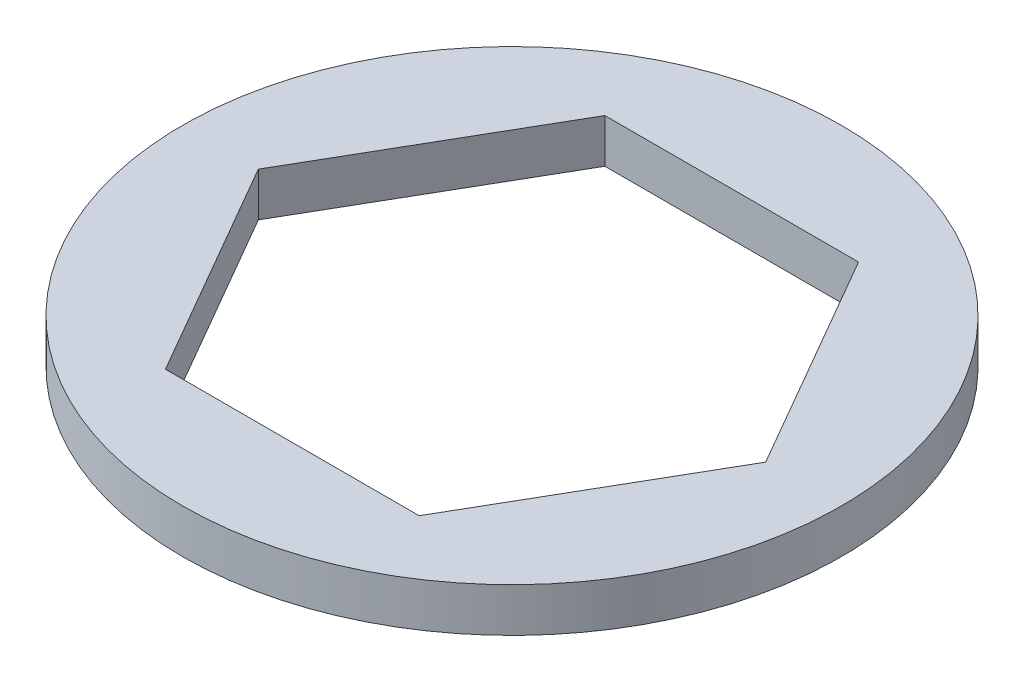
ISO-10303-21;
HEADER;
FILE_DESCRIPTION(('STEP AP214'),'2;1');
FILE_NAME('part.step','',(''),(''),'','','');
FILE_SCHEMA(('AUTOMOTIVE_DESIGN { 1 0 10303 214 1 1 1 1 }'));
ENDSEC;
DATA;
#1=APPLICATION_CONTEXT('core data for automotive mechanical design processes');
#2=APPLICATION_PROTOCOL_DEFINITION('international standard','automotive_design',2000,#1);
#3=PRODUCT_CONTEXT('',#1,'mechanical');
#4=PRODUCT('Part','Part','',(#3));
#5=PRODUCT_RELATED_PRODUCT_CATEGORY('part','',(#4));
#6=PRODUCT_DEFINITION_FORMATION('','',#4);
#7=PRODUCT_DEFINITION_CONTEXT('part definition',#1,'design');
#8=PRODUCT_DEFINITION('design','',#6,#7);
#9=PRODUCT_DEFINITION_SHAPE('','',#8);
#10=(LENGTH_UNIT() NAMED_UNIT(*) SI_UNIT(.MILLI.,.METRE.));
#11=(NAMED_UNIT(*) PLANE_ANGLE_UNIT() SI_UNIT($,.RADIAN.));
#12=(NAMED_UNIT(*) SI_UNIT($,.STERADIAN.) SOLID_ANGLE_UNIT());
#13=UNCERTAINTY_MEASURE_WITH_UNIT(LENGTH_MEASURE(1.E-05),#10,'distance_accuracy_value','');
#14=(GEOMETRIC_REPRESENTATION_CONTEXT(3) GLOBAL_UNCERTAINTY_ASSIGNED_CONTEXT((#13)) GLOBAL_UNIT_ASSIGNED_CONTEXT((#10,
#11,#12)) REPRESENTATION_CONTEXT('',''));
#15=CARTESIAN_POINT('',(0.,0.,0.));
#16=DIRECTION('',(0.,0.,1.));
#17=DIRECTION('',(1.,0.,0.));
#18=AXIS2_PLACEMENT_3D('',#15,#16,#17);
#19=CARTESIAN_POINT('',(0.,1.27,0.));
#20=DIRECTION('',(0.,1.,0.));
#21=DIRECTION('',(0.,0.,1.));
#22=AXIS2_PLACEMENT_3D('',#19,#20,#21);
#23=PLANE('',#22);
#24=CARTESIAN_POINT('',(0.,1.27,0.));
#25=DIRECTION('',(0.,1.,0.));
#26=DIRECTION('',(0.,0.,1.));
#27=AXIS2_PLACEMENT_3D('',#24,#25,#26);
#28=CIRCLE('',#27,9.525);
#29=CARTESIAN_POINT('',(0.,1.27,9.525));
#30=VERTEX_POINT('',#29);
#31=EDGE_CURVE('E11',#30,#30,#28,.T.);
#32=ORIENTED_EDGE('',*,*,#31,.T.);
#33=EDGE_LOOP('',(#32));
#34=FACE_BOUND('',#33,.T.);
#35=DIRECTION('',(-1.,0.,0.));
#36=VECTOR('',#35,1.);
#37=CARTESIAN_POINT('',(3.66617420935412,1.27,-6.35));
#38=LINE('',#37,#36);
#39=CARTESIAN_POINT('',(3.66617420935412,1.27,-6.35));
#40=VERTEX_POINT('',#39);
#41=CARTESIAN_POINT('',(-3.66617420935412,1.27,-6.35));
#42=VERTEX_POINT('',#41);
#43=EDGE_CURVE('E102',#40,#42,#38,.T.);
#44=ORIENTED_EDGE('',*,*,#43,.F.);
#45=DIRECTION('',(-0.5,0.,-0.866025403784439));
#46=VECTOR('',#45,1.);
#47=CARTESIAN_POINT('',(7.33234841870825,1.27,0.));
#48=LINE('',#47,#46);
#49=CARTESIAN_POINT('',(7.33234841870825,1.27,0.));
#50=VERTEX_POINT('',#49);
#51=EDGE_CURVE('E93',#50,#40,#48,.T.);
#52=ORIENTED_EDGE('',*,*,#51,.F.);
#53=DIRECTION('',(0.5,0.,-0.866025403784439));
#54=VECTOR('',#53,1.);
#55=CARTESIAN_POINT('',(3.66617420935413,1.27,6.35));
#56=LINE('',#55,#54);
#57=CARTESIAN_POINT('',(3.66617420935413,1.27,6.35));
#58=VERTEX_POINT('',#57);
#59=EDGE_CURVE('E127',#58,#50,#56,.T.);
#60=ORIENTED_EDGE('',*,*,#59,.F.);
#61=DIRECTION('',(1.,0.,0.));
#62=VECTOR('',#61,1.);
#63=CARTESIAN_POINT('',(-3.66617420935412,1.27,6.35));
#64=LINE('',#63,#62);
#65=CARTESIAN_POINT('',(-3.66617420935412,1.27,6.35));
#66=VERTEX_POINT('',#65);
#67=EDGE_CURVE('E124',#66,#58,#64,.T.);
#68=ORIENTED_EDGE('',*,*,#67,.F.);
#69=DIRECTION('',(0.5,0.,0.866025403784438));
#70=VECTOR('',#69,1.);
#71=CARTESIAN_POINT('',(-7.33234841870825,1.27,0.));
#72=LINE('',#71,#70);
#73=CARTESIAN_POINT('',(-7.33234841870825,1.27,0.));
#74=VERTEX_POINT('',#73);
#75=EDGE_CURVE('E119',#74,#66,#72,.T.);
#76=ORIENTED_EDGE('',*,*,#75,.F.);
#77=DIRECTION('',(-0.5,0.,0.866025403784439));
#78=VECTOR('',#77,1.);
#79=CARTESIAN_POINT('',(-3.66617420935412,1.27,-6.35));
#80=LINE('',#79,#78);
#81=EDGE_CURVE('E115',#42,#74,#80,.T.);
#82=ORIENTED_EDGE('',*,*,#81,.F.);
#83=EDGE_LOOP('',(#44,#52,#60,#68,#76,#82));
#84=FACE_BOUND('',#83,.T.);
#85=ADVANCED_FACE('F39',(#34,#84),#23,.T.);
#86=CARTESIAN_POINT('',(0.,0.,0.));
#87=DIRECTION('',(0.,1.,0.));
#88=DIRECTION('',(0.,0.,1.));
#89=AXIS2_PLACEMENT_3D('',#86,#87,#88);
#90=PLANE('',#89);
#91=CARTESIAN_POINT('',(0.,0.,0.));
#92=DIRECTION('',(0.,1.,0.));
#93=DIRECTION('',(0.,0.,1.));
#94=AXIS2_PLACEMENT_3D('',#91,#92,#93);
#95=CIRCLE('',#94,9.525);
#96=CARTESIAN_POINT('',(0.,0.,9.525));
#97=VERTEX_POINT('',#96);
#98=EDGE_CURVE('E43',#97,#97,#95,.T.);
#99=ORIENTED_EDGE('',*,*,#98,.F.);
#100=EDGE_LOOP('',(#99));
#101=FACE_BOUND('',#100,.T.);
#102=DIRECTION('',(-0.5,0.,-0.866025403784439));
#103=VECTOR('',#102,1.);
#104=CARTESIAN_POINT('',(7.33234841870825,0.,0.));
#105=LINE('',#104,#103);
#106=CARTESIAN_POINT('',(7.33234841870825,0.,0.));
#107=VERTEX_POINT('',#106);
#108=CARTESIAN_POINT('',(3.66617420935412,0.,-6.35));
#109=VERTEX_POINT('',#108);
#110=EDGE_CURVE('E63',#107,#109,#105,.T.);
#111=ORIENTED_EDGE('',*,*,#110,.T.);
#112=DIRECTION('',(-1.,0.,0.));
#113=VECTOR('',#112,1.);
#114=CARTESIAN_POINT('',(3.66617420935412,0.,-6.35));
#115=LINE('',#114,#113);
#116=CARTESIAN_POINT('',(-3.66617420935412,0.,-6.35));
#117=VERTEX_POINT('',#116);
#118=EDGE_CURVE('E109',#109,#117,#115,.T.);
#119=ORIENTED_EDGE('',*,*,#118,.T.);
#120=DIRECTION('',(-0.5,0.,0.866025403784439));
#121=VECTOR('',#120,1.);
#122=CARTESIAN_POINT('',(-3.66617420935412,0.,-6.35));
#123=LINE('',#122,#121);
#124=CARTESIAN_POINT('',(-7.33234841870825,0.,0.));
#125=VERTEX_POINT('',#124);
#126=EDGE_CURVE('E134',#117,#125,#123,.T.);
#127=ORIENTED_EDGE('',*,*,#126,.T.);
#128=DIRECTION('',(0.5,0.,0.866025403784438));
#129=VECTOR('',#128,1.);
#130=CARTESIAN_POINT('',(-7.33234841870825,0.,0.));
#131=LINE('',#130,#129);
#132=CARTESIAN_POINT('',(-3.66617420935412,0.,6.35));
#133=VERTEX_POINT('',#132);
#134=EDGE_CURVE('E138',#125,#133,#131,.T.);
#135=ORIENTED_EDGE('',*,*,#134,.T.);
#136=DIRECTION('',(1.,0.,0.));
#137=VECTOR('',#136,1.);
#138=CARTESIAN_POINT('',(-3.66617420935412,0.,6.35));
#139=LINE('',#138,#137);
#140=CARTESIAN_POINT('',(3.66617420935413,0.,6.35));
#141=VERTEX_POINT('',#140);
#142=EDGE_CURVE('E142',#133,#141,#139,.T.);
#143=ORIENTED_EDGE('',*,*,#142,.T.);
#144=DIRECTION('',(0.5,0.,-0.866025403784439));
#145=VECTOR('',#144,1.);
#146=CARTESIAN_POINT('',(3.66617420935413,0.,6.35));
#147=LINE('',#146,#145);
#148=EDGE_CURVE('E103',#141,#107,#147,.T.);
#149=ORIENTED_EDGE('',*,*,#148,.T.);
#150=EDGE_LOOP('',(#111,#119,#127,#135,#143,#149));
#151=FACE_BOUND('',#150,.T.);
#152=ADVANCED_FACE('F166',(#101,#151),#90,.F.);
#153=CARTESIAN_POINT('',(0.,1.27,0.));
#154=DIRECTION('',(0.,-1.,0.));
#155=DIRECTION('',(0.,0.,-1.));
#156=AXIS2_PLACEMENT_3D('',#153,#154,#155);
#157=CYLINDRICAL_SURFACE('',#156,9.525);
#158=ORIENTED_EDGE('',*,*,#31,.F.);
#159=EDGE_LOOP('',(#158));
#160=FACE_BOUND('',#159,.T.);
#161=ORIENTED_EDGE('',*,*,#98,.T.);
#162=EDGE_LOOP('',(#161));
#163=FACE_BOUND('',#162,.T.);
#164=ADVANCED_FACE('F41',(#160,#163),#157,.T.);
#165=CARTESIAN_POINT('',(7.33234841870825,1.27,0.));
#166=DIRECTION('',(-0.866025403784438,0.,0.5));
#167=DIRECTION('',(0.5,0.,0.866025403784439));
#168=AXIS2_PLACEMENT_3D('',#165,#166,#167);
#169=PLANE('',#168);
#170=ORIENTED_EDGE('',*,*,#110,.F.);
#171=DIRECTION('',(0.,-1.,0.));
#172=VECTOR('',#171,1.);
#173=CARTESIAN_POINT('',(7.33234841870825,1.27,0.));
#174=LINE('',#173,#172);
#175=EDGE_CURVE('E97',#50,#107,#174,.T.);
#176=ORIENTED_EDGE('',*,*,#175,.F.);
#177=ORIENTED_EDGE('',*,*,#51,.T.);
#178=DIRECTION('',(0.,-1.,0.));
#179=VECTOR('',#178,1.);
#180=CARTESIAN_POINT('',(3.66617420935412,1.27,-6.35));
#181=LINE('',#180,#179);
#182=EDGE_CURVE('E96',#40,#109,#181,.T.);
#183=ORIENTED_EDGE('',*,*,#182,.T.);
#184=EDGE_LOOP('',(#170,#176,#177,#183));
#185=FACE_BOUND('',#184,.T.);
#186=ADVANCED_FACE('F95',(#185),#169,.T.);
#187=CARTESIAN_POINT('',(3.66617420935412,1.27,-6.35));
#188=DIRECTION('',(0.,0.,1.));
#189=DIRECTION('',(1.,0.,0.));
#190=AXIS2_PLACEMENT_3D('',#187,#188,#189);
#191=PLANE('',#190);
#192=ORIENTED_EDGE('',*,*,#118,.F.);
#193=ORIENTED_EDGE('',*,*,#182,.F.);
#194=ORIENTED_EDGE('',*,*,#43,.T.);
#195=DIRECTION('',(0.,-1.,0.));
#196=VECTOR('',#195,1.);
#197=CARTESIAN_POINT('',(-3.66617420935412,1.27,-6.35));
#198=LINE('',#197,#196);
#199=EDGE_CURVE('E111',#42,#117,#198,.T.);
#200=ORIENTED_EDGE('',*,*,#199,.T.);
#201=EDGE_LOOP('',(#192,#193,#194,#200));
#202=FACE_BOUND('',#201,.T.);
#203=ADVANCED_FACE('F106',(#202),#191,.T.);
#204=CARTESIAN_POINT('',(-3.66617420935412,1.27,-6.35));
#205=DIRECTION('',(0.866025403784439,0.,0.5));
#206=DIRECTION('',(0.5,0.,-0.866025403784439));
#207=AXIS2_PLACEMENT_3D('',#204,#205,#206);
#208=PLANE('',#207);
#209=ORIENTED_EDGE('',*,*,#126,.F.);
#210=ORIENTED_EDGE('',*,*,#199,.F.);
#211=ORIENTED_EDGE('',*,*,#81,.T.);
#212=DIRECTION('',(0.,-1.,0.));
#213=VECTOR('',#212,1.);
#214=CARTESIAN_POINT('',(-7.33234841870825,1.27,0.));
#215=LINE('',#214,#213);
#216=EDGE_CURVE('E156',#74,#125,#215,.T.);
#217=ORIENTED_EDGE('',*,*,#216,.T.);
#218=EDGE_LOOP('',(#209,#210,#211,#217));
#219=FACE_BOUND('',#218,.T.);
#220=ADVANCED_FACE('F162',(#219),#208,.T.);
#221=CARTESIAN_POINT('',(-7.33234841870825,1.27,0.));
#222=DIRECTION('',(0.866025403784438,0.,-0.5));
#223=DIRECTION('',(-0.5,0.,-0.866025403784438));
#224=AXIS2_PLACEMENT_3D('',#221,#222,#223);
#225=PLANE('',#224);
#226=ORIENTED_EDGE('',*,*,#134,.F.);
#227=ORIENTED_EDGE('',*,*,#216,.F.);
#228=ORIENTED_EDGE('',*,*,#75,.T.);
#229=DIRECTION('',(0.,-1.,0.));
#230=VECTOR('',#229,1.);
#231=CARTESIAN_POINT('',(-3.66617420935412,1.27,6.35));
#232=LINE('',#231,#230);
#233=EDGE_CURVE('E153',#66,#133,#232,.T.);
#234=ORIENTED_EDGE('',*,*,#233,.T.);
#235=EDGE_LOOP('',(#226,#227,#228,#234));
#236=FACE_BOUND('',#235,.T.);
#237=ADVANCED_FACE('F174',(#236),#225,.T.);
#238=CARTESIAN_POINT('',(-3.66617420935412,1.27,6.35));
#239=DIRECTION('',(0.,0.,-1.));
#240=DIRECTION('',(-1.,0.,0.));
#241=AXIS2_PLACEMENT_3D('',#238,#239,#240);
#242=PLANE('',#241);
#243=ORIENTED_EDGE('',*,*,#142,.F.);
#244=ORIENTED_EDGE('',*,*,#233,.F.);
#245=ORIENTED_EDGE('',*,*,#67,.T.);
#246=DIRECTION('',(0.,-1.,0.));
#247=VECTOR('',#246,1.);
#248=CARTESIAN_POINT('',(3.66617420935413,1.27,6.35));
#249=LINE('',#248,#247);
#250=EDGE_CURVE('E55',#58,#141,#249,.T.);
#251=ORIENTED_EDGE('',*,*,#250,.T.);
#252=EDGE_LOOP('',(#243,#244,#245,#251));
#253=FACE_BOUND('',#252,.T.);
#254=ADVANCED_FACE('F172',(#253),#242,.T.);
#255=CARTESIAN_POINT('',(3.66617420935413,1.27,6.35));
#256=DIRECTION('',(-0.866025403784439,0.,-0.5));
#257=DIRECTION('',(-0.5,0.,0.866025403784439));
#258=AXIS2_PLACEMENT_3D('',#255,#256,#257);
#259=PLANE('',#258);
#260=ORIENTED_EDGE('',*,*,#148,.F.);
#261=ORIENTED_EDGE('',*,*,#250,.F.);
#262=ORIENTED_EDGE('',*,*,#59,.T.);
#263=ORIENTED_EDGE('',*,*,#175,.T.);
#264=EDGE_LOOP('',(#260,#261,#262,#263));
#265=FACE_BOUND('',#264,.T.);
#266=ADVANCED_FACE('F168',(#265),#259,.T.);
#267=CLOSED_SHELL('',(#85,#152,#164,#186,#203,#220,#237,#254,#266));
#268=MANIFOLD_SOLID_BREP('B2',#267);
#269=ADVANCED_BREP_SHAPE_REPRESENTATION('',(#18,#268),#14);
#270=SHAPE_DEFINITION_REPRESENTATION(#9,#269);
ENDSEC;
END-ISO-10303-21;
